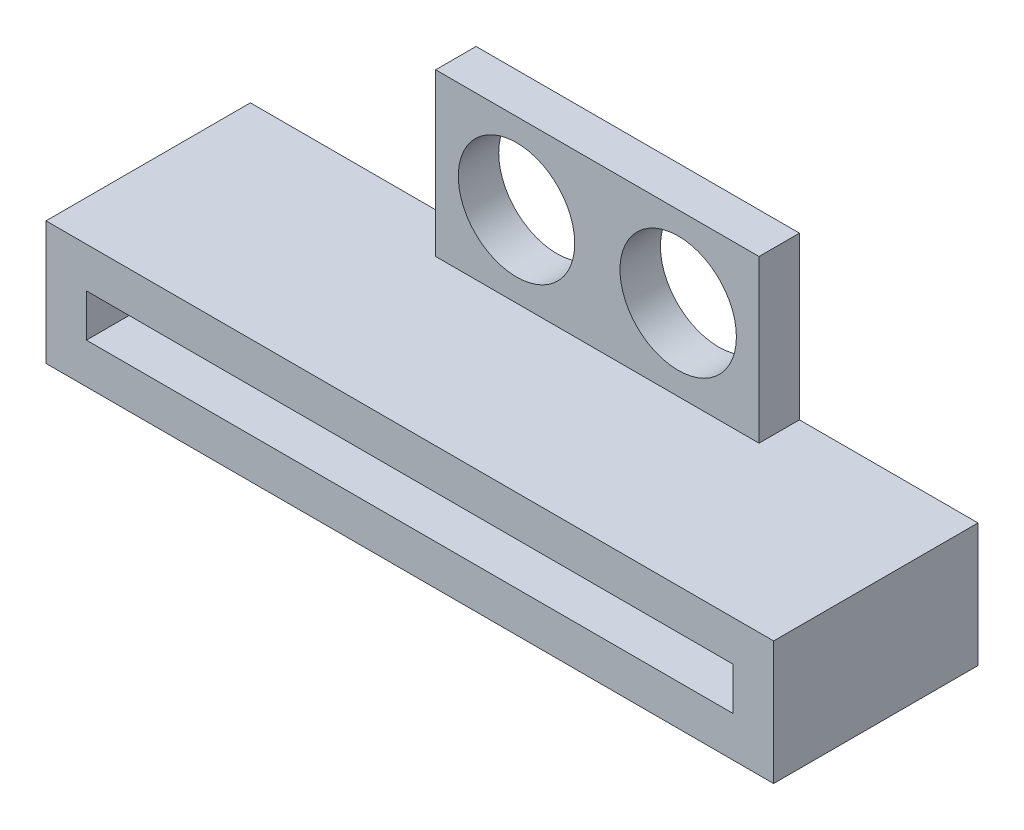
ISO-10303-21;
HEADER;
FILE_DESCRIPTION(('STEP AP214'),'2;1');
FILE_NAME('part.step','',(''),(''),'','','');
FILE_SCHEMA(('AUTOMOTIVE_DESIGN { 1 0 10303 214 1 1 1 1 }'));
ENDSEC;
DATA;
#1=APPLICATION_CONTEXT('core data for automotive mechanical design processes');
#2=APPLICATION_PROTOCOL_DEFINITION('international standard','automotive_design',2000,#1);
#3=PRODUCT_CONTEXT('',#1,'mechanical');
#4=PRODUCT('Part','Part','',(#3));
#5=PRODUCT_RELATED_PRODUCT_CATEGORY('part','',(#4));
#6=PRODUCT_DEFINITION_FORMATION('','',#4);
#7=PRODUCT_DEFINITION_CONTEXT('part definition',#1,'design');
#8=PRODUCT_DEFINITION('design','',#6,#7);
#9=PRODUCT_DEFINITION_SHAPE('','',#8);
#10=(LENGTH_UNIT() NAMED_UNIT(*) SI_UNIT(.MILLI.,.METRE.));
#11=(NAMED_UNIT(*) PLANE_ANGLE_UNIT() SI_UNIT($,.RADIAN.));
#12=(NAMED_UNIT(*) SI_UNIT($,.STERADIAN.) SOLID_ANGLE_UNIT());
#13=UNCERTAINTY_MEASURE_WITH_UNIT(LENGTH_MEASURE(1.E-05),#10,'distance_accuracy_value','');
#14=(GEOMETRIC_REPRESENTATION_CONTEXT(3) GLOBAL_UNCERTAINTY_ASSIGNED_CONTEXT((#13)) GLOBAL_UNIT_ASSIGNED_CONTEXT((#10,
#11,#12)) REPRESENTATION_CONTEXT('',''));
#15=CARTESIAN_POINT('',(0.,0.,0.));
#16=DIRECTION('',(0.,0.,1.));
#17=DIRECTION('',(1.,0.,0.));
#18=AXIS2_PLACEMENT_3D('',#15,#16,#17);
#19=CARTESIAN_POINT('',(0.,0.,-3.175));
#20=DIRECTION('',(0.,0.,-1.));
#21=DIRECTION('',(-1.,0.,0.));
#22=AXIS2_PLACEMENT_3D('',#19,#20,#21);
#23=PLANE('',#22);
#24=CARTESIAN_POINT('',(10.4509560598286,4.7625,-3.175));
#25=DIRECTION('',(0.,0.,-1.));
#26=DIRECTION('',(-1.,0.,0.));
#27=AXIS2_PLACEMENT_3D('',#24,#25,#26);
#28=CIRCLE('',#27,2.286);
#29=CARTESIAN_POINT('',(8.16495605982856,4.7625,-3.175));
#30=VERTEX_POINT('',#29);
#31=EDGE_CURVE('E207',#30,#30,#28,.F.);
#32=ORIENTED_EDGE('',*,*,#31,.T.);
#33=EDGE_LOOP('',(#32));
#34=FACE_BOUND('',#33,.T.);
#35=DIRECTION('',(0.,-1.,0.));
#36=VECTOR('',#35,1.);
#37=CARTESIAN_POINT('',(26.9875,1.5875,-3.175));
#38=LINE('',#37,#36);
#39=CARTESIAN_POINT('',(26.9875,1.5875,-3.175));
#40=VERTEX_POINT('',#39);
#41=CARTESIAN_POINT('',(26.9875,-3.2639,-3.175));
#42=VERTEX_POINT('',#41);
#43=EDGE_CURVE('E172',#40,#42,#38,.T.);
#44=ORIENTED_EDGE('',*,*,#43,.T.);
#45=DIRECTION('',(-1.,0.,0.));
#46=VECTOR('',#45,1.);
#47=CARTESIAN_POINT('',(26.9875,-3.2639,-3.175));
#48=LINE('',#47,#46);
#49=CARTESIAN_POINT('',(-1.5875,-3.2639,-3.175));
#50=VERTEX_POINT('',#49);
#51=EDGE_CURVE('E170',#42,#50,#48,.T.);
#52=ORIENTED_EDGE('',*,*,#51,.T.);
#53=DIRECTION('',(0.,1.,0.));
#54=VECTOR('',#53,1.);
#55=CARTESIAN_POINT('',(-1.5875,1.5875,-3.175));
#56=LINE('',#55,#54);
#57=CARTESIAN_POINT('',(-1.5875,1.5875,-3.175));
#58=VERTEX_POINT('',#57);
#59=EDGE_CURVE('E167',#50,#58,#56,.T.);
#60=ORIENTED_EDGE('',*,*,#59,.T.);
#61=DIRECTION('',(1.,0.,0.));
#62=VECTOR('',#61,1.);
#63=CARTESIAN_POINT('',(26.9875,1.5875,-3.175));
#64=LINE('',#63,#62);
#65=CARTESIAN_POINT('',(7.27595605982856,1.5875,-3.175));
#66=VERTEX_POINT('',#65);
#67=EDGE_CURVE('E152',#58,#66,#64,.T.);
#68=ORIENTED_EDGE('',*,*,#67,.T.);
#69=DIRECTION('',(0.,-1.,0.));
#70=VECTOR('',#69,1.);
#71=CARTESIAN_POINT('',(7.27595605982856,7.9375,-3.175));
#72=LINE('',#71,#70);
#73=CARTESIAN_POINT('',(7.27595605982856,7.9375,-3.175));
#74=VERTEX_POINT('',#73);
#75=EDGE_CURVE('E180',#74,#66,#72,.T.);
#76=ORIENTED_EDGE('',*,*,#75,.F.);
#77=DIRECTION('',(-1.,0.,0.));
#78=VECTOR('',#77,1.);
#79=CARTESIAN_POINT('',(0.,7.9375,-3.175));
#80=LINE('',#79,#78);
#81=CARTESIAN_POINT('',(19.9759560598286,7.9375,-3.175));
#82=VERTEX_POINT('',#81);
#83=EDGE_CURVE('E197',#82,#74,#80,.T.);
#84=ORIENTED_EDGE('',*,*,#83,.F.);
#85=DIRECTION('',(0.,-1.,0.));
#86=VECTOR('',#85,1.);
#87=CARTESIAN_POINT('',(19.9759560598286,7.9375,-3.175));
#88=LINE('',#87,#86);
#89=CARTESIAN_POINT('',(19.9759560598286,1.5875,-3.175));
#90=VERTEX_POINT('',#89);
#91=EDGE_CURVE('E177',#82,#90,#88,.T.);
#92=ORIENTED_EDGE('',*,*,#91,.T.);
#93=EDGE_CURVE('E166',#90,#40,#64,.T.);
#94=ORIENTED_EDGE('',*,*,#93,.T.);
#95=EDGE_LOOP('',(#44,#52,#60,#68,#76,#84,#92,#94));
#96=FACE_BOUND('',#95,.T.);
#97=CARTESIAN_POINT('',(16.8009560598286,4.7625,-3.175));
#98=DIRECTION('',(0.,0.,-1.));
#99=DIRECTION('',(-1.,0.,0.));
#100=AXIS2_PLACEMENT_3D('',#97,#98,#99);
#101=CIRCLE('',#100,2.286);
#102=CARTESIAN_POINT('',(14.5149560598286,4.7625,-3.175));
#103=VERTEX_POINT('',#102);
#104=EDGE_CURVE('E194',#103,#103,#101,.T.);
#105=ORIENTED_EDGE('',*,*,#104,.F.);
#106=EDGE_LOOP('',(#105));
#107=FACE_BOUND('',#106,.T.);
#108=ADVANCED_FACE('F35',(#34,#96,#107),#23,.T.);
#109=CARTESIAN_POINT('',(0.,7.9375,-1.5875));
#110=DIRECTION('',(0.,0.,1.));
#111=DIRECTION('',(1.,0.,0.));
#112=AXIS2_PLACEMENT_3D('',#109,#110,#111);
#113=PLANE('',#112);
#114=CARTESIAN_POINT('',(10.4509560598286,4.7625,-1.5875));
#115=DIRECTION('',(0.,0.,1.));
#116=DIRECTION('',(1.,0.,0.));
#117=AXIS2_PLACEMENT_3D('',#114,#115,#116);
#118=CIRCLE('',#117,2.286);
#119=CARTESIAN_POINT('',(12.7369560598286,4.7625,-1.5875));
#120=VERTEX_POINT('',#119);
#121=EDGE_CURVE('E211',#120,#120,#118,.F.);
#122=ORIENTED_EDGE('',*,*,#121,.T.);
#123=EDGE_LOOP('',(#122));
#124=FACE_BOUND('',#123,.T.);
#125=DIRECTION('',(-1.,0.,0.));
#126=VECTOR('',#125,1.);
#127=CARTESIAN_POINT('',(0.,1.5875,-1.5875));
#128=LINE('',#127,#126);
#129=CARTESIAN_POINT('',(19.9759560598286,1.5875,-1.5875));
#130=VERTEX_POINT('',#129);
#131=CARTESIAN_POINT('',(7.27595605982856,1.5875,-1.5875));
#132=VERTEX_POINT('',#131);
#133=EDGE_CURVE('E52',#130,#132,#128,.T.);
#134=ORIENTED_EDGE('',*,*,#133,.F.);
#135=DIRECTION('',(0.,-1.,0.));
#136=VECTOR('',#135,1.);
#137=CARTESIAN_POINT('',(19.9759560598286,7.9375,-1.5875));
#138=LINE('',#137,#136);
#139=CARTESIAN_POINT('',(19.9759560598286,7.9375,-1.5875));
#140=VERTEX_POINT('',#139);
#141=EDGE_CURVE('E175',#140,#130,#138,.T.);
#142=ORIENTED_EDGE('',*,*,#141,.F.);
#143=DIRECTION('',(-1.,0.,0.));
#144=VECTOR('',#143,1.);
#145=CARTESIAN_POINT('',(0.,7.9375,-1.5875));
#146=LINE('',#145,#144);
#147=CARTESIAN_POINT('',(7.27595605982856,7.9375,-1.5875));
#148=VERTEX_POINT('',#147);
#149=EDGE_CURVE('E189',#140,#148,#146,.T.);
#150=ORIENTED_EDGE('',*,*,#149,.T.);
#151=DIRECTION('',(0.,-1.,0.));
#152=VECTOR('',#151,1.);
#153=CARTESIAN_POINT('',(7.27595605982856,7.9375,-1.5875));
#154=LINE('',#153,#152);
#155=EDGE_CURVE('E183',#148,#132,#154,.T.);
#156=ORIENTED_EDGE('',*,*,#155,.T.);
#157=EDGE_LOOP('',(#134,#142,#150,#156));
#158=FACE_BOUND('',#157,.T.);
#159=CARTESIAN_POINT('',(16.8009560598286,4.7625,-1.5875));
#160=DIRECTION('',(0.,0.,1.));
#161=DIRECTION('',(1.,0.,0.));
#162=AXIS2_PLACEMENT_3D('',#159,#160,#161);
#163=CIRCLE('',#162,2.286);
#164=CARTESIAN_POINT('',(19.0869560598286,4.7625,-1.5875));
#165=VERTEX_POINT('',#164);
#166=EDGE_CURVE('E210',#165,#165,#163,.T.);
#167=ORIENTED_EDGE('',*,*,#166,.F.);
#168=EDGE_LOOP('',(#167));
#169=FACE_BOUND('',#168,.T.);
#170=ADVANCED_FACE('F219',(#124,#158,#169),#113,.T.);
#171=CARTESIAN_POINT('',(0.,0.,4.8514));
#172=DIRECTION('',(1.,0.,0.));
#173=DIRECTION('',(0.,1.,0.));
#174=AXIS2_PLACEMENT_3D('',#171,#172,#173);
#175=PLANE('',#174);
#176=DIRECTION('',(0.,-1.,0.));
#177=VECTOR('',#176,1.);
#178=CARTESIAN_POINT('',(0.,0.,0.));
#179=LINE('',#178,#177);
#180=CARTESIAN_POINT('',(0.,0.,0.));
#181=VERTEX_POINT('',#180);
#182=CARTESIAN_POINT('',(0.,-1.6764,0.));
#183=VERTEX_POINT('',#182);
#184=EDGE_CURVE('E84',#181,#183,#179,.T.);
#185=ORIENTED_EDGE('',*,*,#184,.F.);
#186=DIRECTION('',(0.,0.,-1.));
#187=VECTOR('',#186,1.);
#188=CARTESIAN_POINT('',(0.,0.,4.8514));
#189=LINE('',#188,#187);
#190=CARTESIAN_POINT('',(0.,0.,4.8514));
#191=VERTEX_POINT('',#190);
#192=EDGE_CURVE('E11',#191,#181,#189,.T.);
#193=ORIENTED_EDGE('',*,*,#192,.F.);
#194=DIRECTION('',(0.,-1.,0.));
#195=VECTOR('',#194,1.);
#196=CARTESIAN_POINT('',(0.,0.,4.8514));
#197=LINE('',#196,#195);
#198=CARTESIAN_POINT('',(0.,-1.6764,4.8514));
#199=VERTEX_POINT('',#198);
#200=EDGE_CURVE('E117',#191,#199,#197,.T.);
#201=ORIENTED_EDGE('',*,*,#200,.T.);
#202=DIRECTION('',(0.,0.,-1.));
#203=VECTOR('',#202,1.);
#204=CARTESIAN_POINT('',(0.,-1.6764,4.8514));
#205=LINE('',#204,#203);
#206=EDGE_CURVE('E61',#199,#183,#205,.T.);
#207=ORIENTED_EDGE('',*,*,#206,.T.);
#208=EDGE_LOOP('',(#185,#193,#201,#207));
#209=FACE_BOUND('',#208,.T.);
#210=ADVANCED_FACE('F221',(#209),#175,.T.);
#211=CARTESIAN_POINT('',(0.,0.,4.8514));
#212=DIRECTION('',(0.,1.,0.));
#213=DIRECTION('',(0.,0.,1.));
#214=AXIS2_PLACEMENT_3D('',#211,#212,#213);
#215=PLANE('',#214);
#216=DIRECTION('',(1.,0.,0.));
#217=VECTOR('',#216,1.);
#218=CARTESIAN_POINT('',(0.,0.,0.));
#219=LINE('',#218,#217);
#220=CARTESIAN_POINT('',(25.4,0.,0.));
#221=VERTEX_POINT('',#220);
#222=EDGE_CURVE('E121',#181,#221,#219,.T.);
#223=ORIENTED_EDGE('',*,*,#222,.T.);
#224=DIRECTION('',(0.,0.,-1.));
#225=VECTOR('',#224,1.);
#226=CARTESIAN_POINT('',(25.4,0.,4.8514));
#227=LINE('',#226,#225);
#228=CARTESIAN_POINT('',(25.4,0.,4.8514));
#229=VERTEX_POINT('',#228);
#230=EDGE_CURVE('E44',#229,#221,#227,.T.);
#231=ORIENTED_EDGE('',*,*,#230,.F.);
#232=DIRECTION('',(1.,0.,0.));
#233=VECTOR('',#232,1.);
#234=CARTESIAN_POINT('',(0.,0.,4.8514));
#235=LINE('',#234,#233);
#236=EDGE_CURVE('E112',#191,#229,#235,.T.);
#237=ORIENTED_EDGE('',*,*,#236,.F.);
#238=ORIENTED_EDGE('',*,*,#192,.T.);
#239=EDGE_LOOP('',(#223,#231,#237,#238));
#240=FACE_BOUND('',#239,.T.);
#241=ADVANCED_FACE('F120',(#240),#215,.F.);
#242=CARTESIAN_POINT('',(25.4,0.,4.8514));
#243=DIRECTION('',(1.,0.,0.));
#244=DIRECTION('',(0.,0.,-1.));
#245=AXIS2_PLACEMENT_3D('',#242,#243,#244);
#246=PLANE('',#245);
#247=DIRECTION('',(0.,-1.,0.));
#248=VECTOR('',#247,1.);
#249=CARTESIAN_POINT('',(25.4,0.,0.));
#250=LINE('',#249,#248);
#251=CARTESIAN_POINT('',(25.4,-1.6764,0.));
#252=VERTEX_POINT('',#251);
#253=EDGE_CURVE('E75',#221,#252,#250,.T.);
#254=ORIENTED_EDGE('',*,*,#253,.T.);
#255=DIRECTION('',(0.,0.,-1.));
#256=VECTOR('',#255,1.);
#257=CARTESIAN_POINT('',(25.4,-1.6764,4.8514));
#258=LINE('',#257,#256);
#259=CARTESIAN_POINT('',(25.4,-1.6764,4.8514));
#260=VERTEX_POINT('',#259);
#261=EDGE_CURVE('E108',#260,#252,#258,.T.);
#262=ORIENTED_EDGE('',*,*,#261,.F.);
#263=DIRECTION('',(0.,-1.,0.));
#264=VECTOR('',#263,1.);
#265=CARTESIAN_POINT('',(25.4,0.,4.8514));
#266=LINE('',#265,#264);
#267=EDGE_CURVE('E102',#229,#260,#266,.T.);
#268=ORIENTED_EDGE('',*,*,#267,.F.);
#269=ORIENTED_EDGE('',*,*,#230,.T.);
#270=EDGE_LOOP('',(#254,#262,#268,#269));
#271=FACE_BOUND('',#270,.T.);
#272=ADVANCED_FACE('F104',(#271),#246,.F.);
#273=CARTESIAN_POINT('',(-1.5875,0.,4.8514));
#274=DIRECTION('',(-1.,0.,0.));
#275=DIRECTION('',(0.,0.,1.));
#276=AXIS2_PLACEMENT_3D('',#273,#274,#275);
#277=PLANE('',#276);
#278=DIRECTION('',(0.,0.,-1.));
#279=VECTOR('',#278,1.);
#280=CARTESIAN_POINT('',(-1.5875,1.5875,4.8514));
#281=LINE('',#280,#279);
#282=CARTESIAN_POINT('',(-1.5875,1.5875,4.8514));
#283=VERTEX_POINT('',#282);
#284=EDGE_CURVE('E126',#283,#58,#281,.T.);
#285=ORIENTED_EDGE('',*,*,#284,.T.);
#286=ORIENTED_EDGE('',*,*,#59,.F.);
#287=DIRECTION('',(0.,0.,-1.));
#288=VECTOR('',#287,1.);
#289=CARTESIAN_POINT('',(-1.5875,-3.2639,4.8514));
#290=LINE('',#289,#288);
#291=CARTESIAN_POINT('',(-1.5875,-3.2639,4.8514));
#292=VERTEX_POINT('',#291);
#293=EDGE_CURVE('E39',#292,#50,#290,.T.);
#294=ORIENTED_EDGE('',*,*,#293,.F.);
#295=DIRECTION('',(0.,1.,0.));
#296=VECTOR('',#295,1.);
#297=CARTESIAN_POINT('',(-1.5875,0.,4.8514));
#298=LINE('',#297,#296);
#299=EDGE_CURVE('E148',#292,#283,#298,.T.);
#300=ORIENTED_EDGE('',*,*,#299,.T.);
#301=EDGE_LOOP('',(#285,#286,#294,#300));
#302=FACE_BOUND('',#301,.T.);
#303=ADVANCED_FACE('F37',(#302),#277,.T.);
#304=CARTESIAN_POINT('',(0.,-3.2639,4.8514));
#305=DIRECTION('',(0.,1.,0.));
#306=DIRECTION('',(0.,0.,1.));
#307=AXIS2_PLACEMENT_3D('',#304,#305,#306);
#308=PLANE('',#307);
#309=ORIENTED_EDGE('',*,*,#293,.T.);
#310=ORIENTED_EDGE('',*,*,#51,.F.);
#311=DIRECTION('',(0.,0.,-1.));
#312=VECTOR('',#311,1.);
#313=CARTESIAN_POINT('',(26.9875,-3.2639,4.8514));
#314=LINE('',#313,#312);
#315=CARTESIAN_POINT('',(26.9875,-3.2639,4.8514));
#316=VERTEX_POINT('',#315);
#317=EDGE_CURVE('E131',#316,#42,#314,.T.);
#318=ORIENTED_EDGE('',*,*,#317,.F.);
#319=DIRECTION('',(1.,0.,0.));
#320=VECTOR('',#319,1.);
#321=CARTESIAN_POINT('',(0.,-3.2639,4.8514));
#322=LINE('',#321,#320);
#323=EDGE_CURVE('E160',#292,#316,#322,.T.);
#324=ORIENTED_EDGE('',*,*,#323,.F.);
#325=EDGE_LOOP('',(#309,#310,#318,#324));
#326=FACE_BOUND('',#325,.T.);
#327=ADVANCED_FACE('F254',(#326),#308,.F.);
#328=CARTESIAN_POINT('',(26.9875,0.,4.8514));
#329=DIRECTION('',(1.,0.,0.));
#330=DIRECTION('',(0.,0.,-1.));
#331=AXIS2_PLACEMENT_3D('',#328,#329,#330);
#332=PLANE('',#331);
#333=ORIENTED_EDGE('',*,*,#317,.T.);
#334=ORIENTED_EDGE('',*,*,#43,.F.);
#335=DIRECTION('',(0.,0.,-1.));
#336=VECTOR('',#335,1.);
#337=CARTESIAN_POINT('',(26.9875,1.5875,4.8514));
#338=LINE('',#337,#336);
#339=CARTESIAN_POINT('',(26.9875,1.5875,4.8514));
#340=VERTEX_POINT('',#339);
#341=EDGE_CURVE('E129',#340,#40,#338,.T.);
#342=ORIENTED_EDGE('',*,*,#341,.F.);
#343=DIRECTION('',(0.,-1.,0.));
#344=VECTOR('',#343,1.);
#345=CARTESIAN_POINT('',(26.9875,0.,4.8514));
#346=LINE('',#345,#344);
#347=EDGE_CURVE('E158',#340,#316,#346,.T.);
#348=ORIENTED_EDGE('',*,*,#347,.T.);
#349=EDGE_LOOP('',(#333,#334,#342,#348));
#350=FACE_BOUND('',#349,.T.);
#351=ADVANCED_FACE('F251',(#350),#332,.T.);
#352=CARTESIAN_POINT('',(0.,1.5875,4.8514));
#353=DIRECTION('',(0.,1.,0.));
#354=DIRECTION('',(0.,0.,1.));
#355=AXIS2_PLACEMENT_3D('',#352,#353,#354);
#356=PLANE('',#355);
#357=DIRECTION('',(0.,0.,1.));
#358=VECTOR('',#357,1.);
#359=CARTESIAN_POINT('',(7.27595605982856,1.5875,0.));
#360=LINE('',#359,#358);
#361=EDGE_CURVE('E186',#66,#132,#360,.T.);
#362=ORIENTED_EDGE('',*,*,#361,.F.);
#363=ORIENTED_EDGE('',*,*,#67,.F.);
#364=ORIENTED_EDGE('',*,*,#284,.F.);
#365=DIRECTION('',(1.,0.,0.));
#366=VECTOR('',#365,1.);
#367=CARTESIAN_POINT('',(0.,1.5875,4.8514));
#368=LINE('',#367,#366);
#369=EDGE_CURVE('E155',#283,#340,#368,.T.);
#370=ORIENTED_EDGE('',*,*,#369,.T.);
#371=ORIENTED_EDGE('',*,*,#341,.T.);
#372=ORIENTED_EDGE('',*,*,#93,.F.);
#373=DIRECTION('',(0.,0.,1.));
#374=VECTOR('',#373,1.);
#375=CARTESIAN_POINT('',(19.9759560598286,1.5875,0.));
#376=LINE('',#375,#374);
#377=EDGE_CURVE('E190',#90,#130,#376,.T.);
#378=ORIENTED_EDGE('',*,*,#377,.T.);
#379=ORIENTED_EDGE('',*,*,#133,.T.);
#380=EDGE_LOOP('',(#362,#363,#364,#370,#371,#372,#378,#379));
#381=FACE_BOUND('',#380,.T.);
#382=ADVANCED_FACE('F244',(#381),#356,.T.);
#383=CARTESIAN_POINT('',(0.,-1.6764,4.8514));
#384=DIRECTION('',(0.,1.,0.));
#385=DIRECTION('',(0.,0.,1.));
#386=AXIS2_PLACEMENT_3D('',#383,#384,#385);
#387=PLANE('',#386);
#388=DIRECTION('',(1.,0.,0.));
#389=VECTOR('',#388,1.);
#390=CARTESIAN_POINT('',(0.,-1.6764,0.));
#391=LINE('',#390,#389);
#392=EDGE_CURVE('E146',#183,#252,#391,.T.);
#393=ORIENTED_EDGE('',*,*,#392,.F.);
#394=ORIENTED_EDGE('',*,*,#206,.F.);
#395=DIRECTION('',(1.,0.,0.));
#396=VECTOR('',#395,1.);
#397=CARTESIAN_POINT('',(0.,-1.6764,4.8514));
#398=LINE('',#397,#396);
#399=EDGE_CURVE('E111',#199,#260,#398,.T.);
#400=ORIENTED_EDGE('',*,*,#399,.T.);
#401=ORIENTED_EDGE('',*,*,#261,.T.);
#402=EDGE_LOOP('',(#393,#394,#400,#401));
#403=FACE_BOUND('',#402,.T.);
#404=ADVANCED_FACE('F240',(#403),#387,.T.);
#405=CARTESIAN_POINT('',(0.,0.,4.8514));
#406=DIRECTION('',(0.,0.,1.));
#407=DIRECTION('',(1.,0.,0.));
#408=AXIS2_PLACEMENT_3D('',#405,#406,#407);
#409=PLANE('',#408);
#410=ORIENTED_EDGE('',*,*,#299,.F.);
#411=ORIENTED_EDGE('',*,*,#323,.T.);
#412=ORIENTED_EDGE('',*,*,#347,.F.);
#413=ORIENTED_EDGE('',*,*,#369,.F.);
#414=EDGE_LOOP('',(#410,#411,#412,#413));
#415=FACE_BOUND('',#414,.T.);
#416=ORIENTED_EDGE('',*,*,#200,.F.);
#417=ORIENTED_EDGE('',*,*,#236,.T.);
#418=ORIENTED_EDGE('',*,*,#267,.T.);
#419=ORIENTED_EDGE('',*,*,#399,.F.);
#420=EDGE_LOOP('',(#416,#417,#418,#419));
#421=FACE_BOUND('',#420,.T.);
#422=ADVANCED_FACE('F116',(#415,#421),#409,.T.);
#423=CARTESIAN_POINT('',(0.,0.,0.));
#424=DIRECTION('',(0.,0.,-1.));
#425=DIRECTION('',(-1.,0.,0.));
#426=AXIS2_PLACEMENT_3D('',#423,#424,#425);
#427=PLANE('',#426);
#428=ORIENTED_EDGE('',*,*,#222,.F.);
#429=ORIENTED_EDGE('',*,*,#184,.T.);
#430=ORIENTED_EDGE('',*,*,#392,.T.);
#431=ORIENTED_EDGE('',*,*,#253,.F.);
#432=EDGE_LOOP('',(#428,#429,#430,#431));
#433=FACE_BOUND('',#432,.T.);
#434=ADVANCED_FACE('F235',(#433),#427,.F.);
#435=CARTESIAN_POINT('',(19.9759560598286,7.9375,0.));
#436=DIRECTION('',(1.,0.,0.));
#437=DIRECTION('',(0.,0.,-1.));
#438=AXIS2_PLACEMENT_3D('',#435,#436,#437);
#439=PLANE('',#438);
#440=ORIENTED_EDGE('',*,*,#377,.F.);
#441=ORIENTED_EDGE('',*,*,#91,.F.);
#442=DIRECTION('',(0.,0.,1.));
#443=VECTOR('',#442,1.);
#444=CARTESIAN_POINT('',(19.9759560598286,7.9375,0.));
#445=LINE('',#444,#443);
#446=EDGE_CURVE('E200',#82,#140,#445,.T.);
#447=ORIENTED_EDGE('',*,*,#446,.T.);
#448=ORIENTED_EDGE('',*,*,#141,.T.);
#449=EDGE_LOOP('',(#440,#441,#447,#448));
#450=FACE_BOUND('',#449,.T.);
#451=ADVANCED_FACE('F232',(#450),#439,.T.);
#452=CARTESIAN_POINT('',(7.27595605982856,7.9375,0.));
#453=DIRECTION('',(1.,0.,0.));
#454=DIRECTION('',(0.,0.,-1.));
#455=AXIS2_PLACEMENT_3D('',#452,#453,#454);
#456=PLANE('',#455);
#457=ORIENTED_EDGE('',*,*,#361,.T.);
#458=ORIENTED_EDGE('',*,*,#155,.F.);
#459=DIRECTION('',(0.,0.,1.));
#460=VECTOR('',#459,1.);
#461=CARTESIAN_POINT('',(7.27595605982856,7.9375,0.));
#462=LINE('',#461,#460);
#463=EDGE_CURVE('E185',#74,#148,#462,.T.);
#464=ORIENTED_EDGE('',*,*,#463,.F.);
#465=ORIENTED_EDGE('',*,*,#75,.T.);
#466=EDGE_LOOP('',(#457,#458,#464,#465));
#467=FACE_BOUND('',#466,.T.);
#468=ADVANCED_FACE('F279',(#467),#456,.F.);
#469=CARTESIAN_POINT('',(0.,7.9375,0.));
#470=DIRECTION('',(0.,1.,0.));
#471=DIRECTION('',(0.,0.,1.));
#472=AXIS2_PLACEMENT_3D('',#469,#470,#471);
#473=PLANE('',#472);
#474=ORIENTED_EDGE('',*,*,#149,.F.);
#475=ORIENTED_EDGE('',*,*,#446,.F.);
#476=ORIENTED_EDGE('',*,*,#83,.T.);
#477=ORIENTED_EDGE('',*,*,#463,.T.);
#478=EDGE_LOOP('',(#474,#475,#476,#477));
#479=FACE_BOUND('',#478,.T.);
#480=ADVANCED_FACE('F304',(#479),#473,.T.);
#481=CARTESIAN_POINT('',(10.4509560598286,4.7625,-7.9375));
#482=DIRECTION('',(0.,0.,1.));
#483=DIRECTION('',(1.,0.,0.));
#484=AXIS2_PLACEMENT_3D('',#481,#482,#483);
#485=CYLINDRICAL_SURFACE('',#484,2.286);
#486=ORIENTED_EDGE('',*,*,#31,.F.);
#487=EDGE_LOOP('',(#486));
#488=FACE_BOUND('',#487,.T.);
#489=ORIENTED_EDGE('',*,*,#121,.F.);
#490=EDGE_LOOP('',(#489));
#491=FACE_BOUND('',#490,.T.);
#492=ADVANCED_FACE('F306',(#488,#491),#485,.F.);
#493=CARTESIAN_POINT('',(16.8009560598286,4.7625,-7.9375));
#494=DIRECTION('',(0.,0.,1.));
#495=DIRECTION('',(1.,0.,0.));
#496=AXIS2_PLACEMENT_3D('',#493,#494,#495);
#497=CYLINDRICAL_SURFACE('',#496,2.286);
#498=ORIENTED_EDGE('',*,*,#104,.T.);
#499=EDGE_LOOP('',(#498));
#500=FACE_BOUND('',#499,.T.);
#501=ORIENTED_EDGE('',*,*,#166,.T.);
#502=EDGE_LOOP('',(#501));
#503=FACE_BOUND('',#502,.T.);
#504=ADVANCED_FACE('F217',(#500,#503),#497,.F.);
#505=CLOSED_SHELL('',(#108,#170,#210,#241,#272,#303,#327,#351,#382,#404,#422,#434,#451,#468,
#480,#492,#504));
#506=MANIFOLD_SOLID_BREP('B2',#505);
#507=ADVANCED_BREP_SHAPE_REPRESENTATION('',(#18,#506),#14);
#508=SHAPE_DEFINITION_REPRESENTATION(#9,#507);
ENDSEC;
END-ISO-10303-21;
